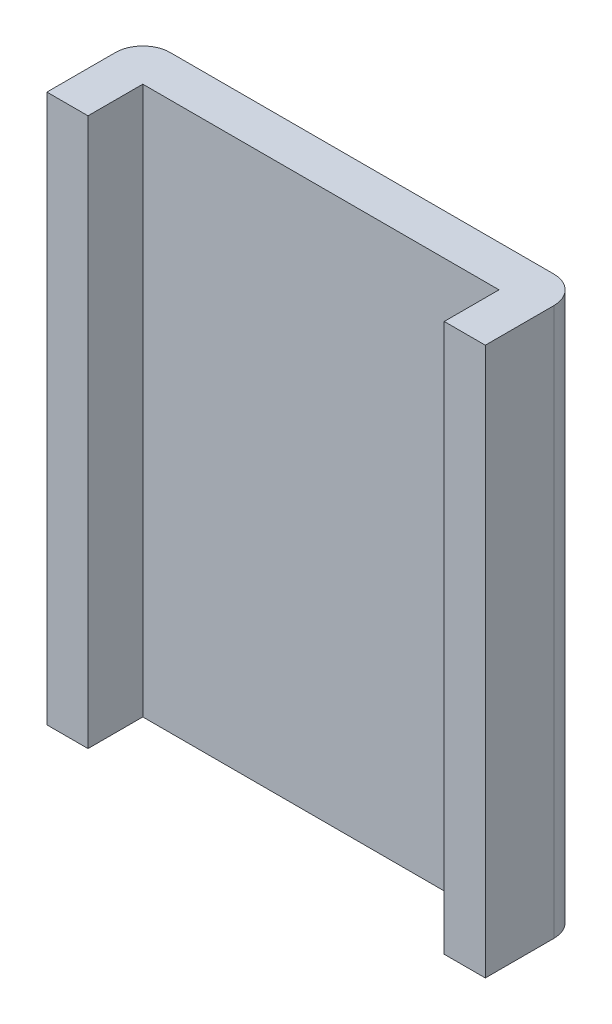
ISO-10303-21;
HEADER;
FILE_DESCRIPTION(('STEP AP214'),'2;1');
FILE_NAME('part.step','',(''),(''),'','','');
FILE_SCHEMA(('AUTOMOTIVE_DESIGN { 1 0 10303 214 1 1 1 1 }'));
ENDSEC;
DATA;
#1=APPLICATION_CONTEXT('core data for automotive mechanical design processes');
#2=APPLICATION_PROTOCOL_DEFINITION('international standard','automotive_design',2000,#1);
#3=PRODUCT_CONTEXT('',#1,'mechanical');
#4=PRODUCT('Part','Part','',(#3));
#5=PRODUCT_RELATED_PRODUCT_CATEGORY('part','',(#4));
#6=PRODUCT_DEFINITION_FORMATION('','',#4);
#7=PRODUCT_DEFINITION_CONTEXT('part definition',#1,'design');
#8=PRODUCT_DEFINITION('design','',#6,#7);
#9=PRODUCT_DEFINITION_SHAPE('','',#8);
#10=(LENGTH_UNIT() NAMED_UNIT(*) SI_UNIT(.MILLI.,.METRE.));
#11=(NAMED_UNIT(*) PLANE_ANGLE_UNIT() SI_UNIT($,.RADIAN.));
#12=(NAMED_UNIT(*) SI_UNIT($,.STERADIAN.) SOLID_ANGLE_UNIT());
#13=UNCERTAINTY_MEASURE_WITH_UNIT(LENGTH_MEASURE(1.E-05),#10,'distance_accuracy_value','');
#14=(GEOMETRIC_REPRESENTATION_CONTEXT(3) GLOBAL_UNCERTAINTY_ASSIGNED_CONTEXT((#13)) GLOBAL_UNIT_ASSIGNED_CONTEXT((#10,
#11,#12)) REPRESENTATION_CONTEXT('',''));
#15=CARTESIAN_POINT('',(0.,0.,0.));
#16=DIRECTION('',(0.,0.,1.));
#17=DIRECTION('',(1.,0.,0.));
#18=AXIS2_PLACEMENT_3D('',#15,#16,#17);
#19=CARTESIAN_POINT('',(0.,5.,0.75));
#20=DIRECTION('',(0.,1.,0.));
#21=DIRECTION('',(0.,0.,1.));
#22=AXIS2_PLACEMENT_3D('',#19,#20,#21);
#23=PLANE('',#22);
#24=DIRECTION('',(0.,0.,-1.));
#25=VECTOR('',#24,1.);
#26=CARTESIAN_POINT('',(4.,5.,1.75));
#27=LINE('',#26,#25);
#28=CARTESIAN_POINT('',(4.,5.,1.75));
#29=VERTEX_POINT('',#28);
#30=CARTESIAN_POINT('',(4.,5.,0.5));
#31=VERTEX_POINT('',#30);
#32=EDGE_CURVE('E155',#29,#31,#27,.T.);
#33=ORIENTED_EDGE('',*,*,#32,.T.);
#34=CARTESIAN_POINT('',(3.5,5.,0.5));
#35=DIRECTION('',(0.,1.,0.));
#36=DIRECTION('',(0.,0.,1.));
#37=AXIS2_PLACEMENT_3D('',#34,#35,#36);
#38=CIRCLE('',#37,0.5);
#39=CARTESIAN_POINT('',(3.5,5.,0.));
#40=VERTEX_POINT('',#39);
#41=EDGE_CURVE('E43',#31,#40,#38,.T.);
#42=ORIENTED_EDGE('',*,*,#41,.T.);
#43=DIRECTION('',(1.,0.,0.));
#44=VECTOR('',#43,1.);
#45=CARTESIAN_POINT('',(0.,5.,0.));
#46=LINE('',#45,#44);
#47=CARTESIAN_POINT('',(-3.5,5.,0.));
#48=VERTEX_POINT('',#47);
#49=EDGE_CURVE('E165',#48,#40,#46,.T.);
#50=ORIENTED_EDGE('',*,*,#49,.F.);
#51=CARTESIAN_POINT('',(-3.5,5.,0.5));
#52=DIRECTION('',(0.,1.,0.));
#53=DIRECTION('',(0.,0.,1.));
#54=AXIS2_PLACEMENT_3D('',#51,#52,#53);
#55=CIRCLE('',#54,0.5);
#56=CARTESIAN_POINT('',(-4.,5.,0.5));
#57=VERTEX_POINT('',#56);
#58=EDGE_CURVE('E50',#48,#57,#55,.T.);
#59=ORIENTED_EDGE('',*,*,#58,.T.);
#60=DIRECTION('',(0.,0.,-1.));
#61=VECTOR('',#60,1.);
#62=CARTESIAN_POINT('',(-4.,5.,1.75));
#63=LINE('',#62,#61);
#64=CARTESIAN_POINT('',(-4.,5.,1.75));
#65=VERTEX_POINT('',#64);
#66=EDGE_CURVE('E124',#65,#57,#63,.T.);
#67=ORIENTED_EDGE('',*,*,#66,.F.);
#68=DIRECTION('',(1.,0.,0.));
#69=VECTOR('',#68,1.);
#70=CARTESIAN_POINT('',(0.,5.,1.75));
#71=LINE('',#70,#69);
#72=CARTESIAN_POINT('',(-3.25,5.,1.75));
#73=VERTEX_POINT('',#72);
#74=EDGE_CURVE('E129',#65,#73,#71,.T.);
#75=ORIENTED_EDGE('',*,*,#74,.T.);
#76=DIRECTION('',(0.,0.,-1.));
#77=VECTOR('',#76,1.);
#78=CARTESIAN_POINT('',(-3.25,5.,1.75));
#79=LINE('',#78,#77);
#80=CARTESIAN_POINT('',(-3.25,5.,0.75));
#81=VERTEX_POINT('',#80);
#82=EDGE_CURVE('E114',#73,#81,#79,.T.);
#83=ORIENTED_EDGE('',*,*,#82,.T.);
#84=DIRECTION('',(1.,0.,0.));
#85=VECTOR('',#84,1.);
#86=CARTESIAN_POINT('',(0.,5.,0.75));
#87=LINE('',#86,#85);
#88=CARTESIAN_POINT('',(3.25,5.,0.75));
#89=VERTEX_POINT('',#88);
#90=EDGE_CURVE('E169',#81,#89,#87,.T.);
#91=ORIENTED_EDGE('',*,*,#90,.T.);
#92=DIRECTION('',(0.,0.,-1.));
#93=VECTOR('',#92,1.);
#94=CARTESIAN_POINT('',(3.25,5.,1.75));
#95=LINE('',#94,#93);
#96=CARTESIAN_POINT('',(3.25,5.,1.75));
#97=VERTEX_POINT('',#96);
#98=EDGE_CURVE('E162',#97,#89,#95,.T.);
#99=ORIENTED_EDGE('',*,*,#98,.F.);
#100=DIRECTION('',(1.,0.,0.));
#101=VECTOR('',#100,1.);
#102=CARTESIAN_POINT('',(0.,5.,1.75));
#103=LINE('',#102,#101);
#104=EDGE_CURVE('E123',#97,#29,#103,.T.);
#105=ORIENTED_EDGE('',*,*,#104,.T.);
#106=EDGE_LOOP('',(#33,#42,#50,#59,#67,#75,#83,#91,#99,#105));
#107=FACE_BOUND('',#106,.T.);
#108=ADVANCED_FACE('F35',(#107),#23,.T.);
#109=CARTESIAN_POINT('',(0.,-5.,0.75));
#110=DIRECTION('',(0.,1.,0.));
#111=DIRECTION('',(0.,0.,1.));
#112=AXIS2_PLACEMENT_3D('',#109,#110,#111);
#113=PLANE('',#112);
#114=DIRECTION('',(1.,0.,0.));
#115=VECTOR('',#114,1.);
#116=CARTESIAN_POINT('',(0.,-5.,0.));
#117=LINE('',#116,#115);
#118=CARTESIAN_POINT('',(-3.5,-5.,0.));
#119=VERTEX_POINT('',#118);
#120=CARTESIAN_POINT('',(3.5,-5.,0.));
#121=VERTEX_POINT('',#120);
#122=EDGE_CURVE('E170',#119,#121,#117,.T.);
#123=ORIENTED_EDGE('',*,*,#122,.T.);
#124=CARTESIAN_POINT('',(3.5,-5.,0.5));
#125=DIRECTION('',(0.,1.,0.));
#126=DIRECTION('',(0.,0.,1.));
#127=AXIS2_PLACEMENT_3D('',#124,#125,#126);
#128=CIRCLE('',#127,0.5);
#129=CARTESIAN_POINT('',(4.,-5.,0.5));
#130=VERTEX_POINT('',#129);
#131=EDGE_CURVE('E186',#121,#130,#128,.F.);
#132=ORIENTED_EDGE('',*,*,#131,.T.);
#133=DIRECTION('',(0.,0.,-1.));
#134=VECTOR('',#133,1.);
#135=CARTESIAN_POINT('',(4.,-5.,1.75));
#136=LINE('',#135,#134);
#137=CARTESIAN_POINT('',(4.,-5.,1.75));
#138=VERTEX_POINT('',#137);
#139=EDGE_CURVE('E157',#138,#130,#136,.T.);
#140=ORIENTED_EDGE('',*,*,#139,.F.);
#141=DIRECTION('',(1.,0.,0.));
#142=VECTOR('',#141,1.);
#143=CARTESIAN_POINT('',(0.,-5.,1.75));
#144=LINE('',#143,#142);
#145=CARTESIAN_POINT('',(3.25,-5.,1.75));
#146=VERTEX_POINT('',#145);
#147=EDGE_CURVE('E150',#146,#138,#144,.T.);
#148=ORIENTED_EDGE('',*,*,#147,.F.);
#149=DIRECTION('',(0.,0.,-1.));
#150=VECTOR('',#149,1.);
#151=CARTESIAN_POINT('',(3.25,-5.,1.75));
#152=LINE('',#151,#150);
#153=CARTESIAN_POINT('',(3.25,-5.,0.75));
#154=VERTEX_POINT('',#153);
#155=EDGE_CURVE('E159',#146,#154,#152,.T.);
#156=ORIENTED_EDGE('',*,*,#155,.T.);
#157=DIRECTION('',(1.,0.,0.));
#158=VECTOR('',#157,1.);
#159=CARTESIAN_POINT('',(0.,-5.,0.75));
#160=LINE('',#159,#158);
#161=CARTESIAN_POINT('',(-3.25,-5.,0.75));
#162=VERTEX_POINT('',#161);
#163=EDGE_CURVE('E173',#162,#154,#160,.T.);
#164=ORIENTED_EDGE('',*,*,#163,.F.);
#165=DIRECTION('',(0.,0.,-1.));
#166=VECTOR('',#165,1.);
#167=CARTESIAN_POINT('',(-3.25,-5.,1.75));
#168=LINE('',#167,#166);
#169=CARTESIAN_POINT('',(-3.25,-5.,1.75));
#170=VERTEX_POINT('',#169);
#171=EDGE_CURVE('E140',#170,#162,#168,.T.);
#172=ORIENTED_EDGE('',*,*,#171,.F.);
#173=DIRECTION('',(1.,0.,0.));
#174=VECTOR('',#173,1.);
#175=CARTESIAN_POINT('',(0.,-5.,1.75));
#176=LINE('',#175,#174);
#177=CARTESIAN_POINT('',(-4.,-5.,1.75));
#178=VERTEX_POINT('',#177);
#179=EDGE_CURVE('E131',#178,#170,#176,.T.);
#180=ORIENTED_EDGE('',*,*,#179,.F.);
#181=DIRECTION('',(0.,0.,-1.));
#182=VECTOR('',#181,1.);
#183=CARTESIAN_POINT('',(-4.,-5.,1.75));
#184=LINE('',#183,#182);
#185=CARTESIAN_POINT('',(-4.,-5.,0.5));
#186=VERTEX_POINT('',#185);
#187=EDGE_CURVE('E142',#178,#186,#184,.T.);
#188=ORIENTED_EDGE('',*,*,#187,.T.);
#189=CARTESIAN_POINT('',(-3.5,-5.,0.5));
#190=DIRECTION('',(0.,1.,0.));
#191=DIRECTION('',(0.,0.,1.));
#192=AXIS2_PLACEMENT_3D('',#189,#190,#191);
#193=CIRCLE('',#192,0.5);
#194=EDGE_CURVE('E184',#186,#119,#193,.F.);
#195=ORIENTED_EDGE('',*,*,#194,.T.);
#196=EDGE_LOOP('',(#123,#132,#140,#148,#156,#164,#172,#180,#188,#195));
#197=FACE_BOUND('',#196,.T.);
#198=ADVANCED_FACE('F199',(#197),#113,.F.);
#199=CARTESIAN_POINT('',(0.,0.,0.75));
#200=DIRECTION('',(0.,0.,1.));
#201=DIRECTION('',(1.,0.,0.));
#202=AXIS2_PLACEMENT_3D('',#199,#200,#201);
#203=PLANE('',#202);
#204=DIRECTION('',(0.,-1.,0.));
#205=VECTOR('',#204,1.);
#206=CARTESIAN_POINT('',(3.25,0.,0.75));
#207=LINE('',#206,#205);
#208=EDGE_CURVE('E166',#89,#154,#207,.T.);
#209=ORIENTED_EDGE('',*,*,#208,.F.);
#210=ORIENTED_EDGE('',*,*,#90,.F.);
#211=DIRECTION('',(0.,-1.,0.));
#212=VECTOR('',#211,1.);
#213=CARTESIAN_POINT('',(-3.25,0.,0.75));
#214=LINE('',#213,#212);
#215=EDGE_CURVE('E119',#81,#162,#214,.T.);
#216=ORIENTED_EDGE('',*,*,#215,.T.);
#217=ORIENTED_EDGE('',*,*,#163,.T.);
#218=EDGE_LOOP('',(#209,#210,#216,#217));
#219=FACE_BOUND('',#218,.T.);
#220=ADVANCED_FACE('F212',(#219),#203,.T.);
#221=CARTESIAN_POINT('',(0.,0.,0.));
#222=DIRECTION('',(0.,0.,1.));
#223=DIRECTION('',(1.,0.,0.));
#224=AXIS2_PLACEMENT_3D('',#221,#222,#223);
#225=PLANE('',#224);
#226=ORIENTED_EDGE('',*,*,#49,.T.);
#227=DIRECTION('',(0.,-1.,0.));
#228=VECTOR('',#227,1.);
#229=CARTESIAN_POINT('',(3.5,-5.,0.));
#230=LINE('',#229,#228);
#231=EDGE_CURVE('E181',#40,#121,#230,.T.);
#232=ORIENTED_EDGE('',*,*,#231,.T.);
#233=ORIENTED_EDGE('',*,*,#122,.F.);
#234=DIRECTION('',(0.,-1.,0.));
#235=VECTOR('',#234,1.);
#236=CARTESIAN_POINT('',(-3.5,0.,0.));
#237=LINE('',#236,#235);
#238=EDGE_CURVE('E175',#119,#48,#237,.F.);
#239=ORIENTED_EDGE('',*,*,#238,.T.);
#240=EDGE_LOOP('',(#226,#232,#233,#239));
#241=FACE_BOUND('',#240,.T.);
#242=ADVANCED_FACE('F193',(#241),#225,.F.);
#243=CARTESIAN_POINT('',(3.25,0.,1.75));
#244=DIRECTION('',(1.,0.,0.));
#245=DIRECTION('',(0.,1.,0.));
#246=AXIS2_PLACEMENT_3D('',#243,#244,#245);
#247=PLANE('',#246);
#248=ORIENTED_EDGE('',*,*,#98,.T.);
#249=ORIENTED_EDGE('',*,*,#208,.T.);
#250=ORIENTED_EDGE('',*,*,#155,.F.);
#251=DIRECTION('',(0.,-1.,0.));
#252=VECTOR('',#251,1.);
#253=CARTESIAN_POINT('',(3.25,0.,1.75));
#254=LINE('',#253,#252);
#255=EDGE_CURVE('E148',#97,#146,#254,.T.);
#256=ORIENTED_EDGE('',*,*,#255,.F.);
#257=EDGE_LOOP('',(#248,#249,#250,#256));
#258=FACE_BOUND('',#257,.T.);
#259=ADVANCED_FACE('F210',(#258),#247,.F.);
#260=CARTESIAN_POINT('',(4.,0.,1.75));
#261=DIRECTION('',(1.,0.,0.));
#262=DIRECTION('',(0.,1.,0.));
#263=AXIS2_PLACEMENT_3D('',#260,#261,#262);
#264=PLANE('',#263);
#265=ORIENTED_EDGE('',*,*,#139,.T.);
#266=DIRECTION('',(0.,-1.,0.));
#267=VECTOR('',#266,1.);
#268=CARTESIAN_POINT('',(4.,5.,0.5));
#269=LINE('',#268,#267);
#270=EDGE_CURVE('E58',#130,#31,#269,.F.);
#271=ORIENTED_EDGE('',*,*,#270,.T.);
#272=ORIENTED_EDGE('',*,*,#32,.F.);
#273=DIRECTION('',(0.,-1.,0.));
#274=VECTOR('',#273,1.);
#275=CARTESIAN_POINT('',(4.,0.,1.75));
#276=LINE('',#275,#274);
#277=EDGE_CURVE('E152',#29,#138,#276,.T.);
#278=ORIENTED_EDGE('',*,*,#277,.T.);
#279=EDGE_LOOP('',(#265,#271,#272,#278));
#280=FACE_BOUND('',#279,.T.);
#281=ADVANCED_FACE('F201',(#280),#264,.T.);
#282=CARTESIAN_POINT('',(0.,0.,1.75));
#283=DIRECTION('',(0.,0.,1.));
#284=DIRECTION('',(1.,0.,0.));
#285=AXIS2_PLACEMENT_3D('',#282,#283,#284);
#286=PLANE('',#285);
#287=ORIENTED_EDGE('',*,*,#104,.F.);
#288=ORIENTED_EDGE('',*,*,#255,.T.);
#289=ORIENTED_EDGE('',*,*,#147,.T.);
#290=ORIENTED_EDGE('',*,*,#277,.F.);
#291=EDGE_LOOP('',(#287,#288,#289,#290));
#292=FACE_BOUND('',#291,.T.);
#293=ADVANCED_FACE('F205',(#292),#286,.T.);
#294=CARTESIAN_POINT('',(-3.25,0.,1.75));
#295=DIRECTION('',(1.,0.,0.));
#296=DIRECTION('',(0.,1.,0.));
#297=AXIS2_PLACEMENT_3D('',#294,#295,#296);
#298=PLANE('',#297);
#299=ORIENTED_EDGE('',*,*,#215,.F.);
#300=ORIENTED_EDGE('',*,*,#82,.F.);
#301=DIRECTION('',(0.,-1.,0.));
#302=VECTOR('',#301,1.);
#303=CARTESIAN_POINT('',(-3.25,0.,1.75));
#304=LINE('',#303,#302);
#305=EDGE_CURVE('E117',#73,#170,#304,.T.);
#306=ORIENTED_EDGE('',*,*,#305,.T.);
#307=ORIENTED_EDGE('',*,*,#171,.T.);
#308=EDGE_LOOP('',(#299,#300,#306,#307));
#309=FACE_BOUND('',#308,.T.);
#310=ADVANCED_FACE('F116',(#309),#298,.T.);
#311=CARTESIAN_POINT('',(-4.,0.,1.75));
#312=DIRECTION('',(1.,0.,0.));
#313=DIRECTION('',(0.,1.,0.));
#314=AXIS2_PLACEMENT_3D('',#311,#312,#313);
#315=PLANE('',#314);
#316=ORIENTED_EDGE('',*,*,#66,.T.);
#317=DIRECTION('',(0.,-1.,0.));
#318=VECTOR('',#317,1.);
#319=CARTESIAN_POINT('',(-4.,0.,0.5));
#320=LINE('',#319,#318);
#321=EDGE_CURVE('E11',#57,#186,#320,.T.);
#322=ORIENTED_EDGE('',*,*,#321,.T.);
#323=ORIENTED_EDGE('',*,*,#187,.F.);
#324=DIRECTION('',(0.,-1.,0.));
#325=VECTOR('',#324,1.);
#326=CARTESIAN_POINT('',(-4.,0.,1.75));
#327=LINE('',#326,#325);
#328=EDGE_CURVE('E135',#65,#178,#327,.T.);
#329=ORIENTED_EDGE('',*,*,#328,.F.);
#330=EDGE_LOOP('',(#316,#322,#323,#329));
#331=FACE_BOUND('',#330,.T.);
#332=ADVANCED_FACE('F232',(#331),#315,.F.);
#333=CARTESIAN_POINT('',(0.,0.,1.75));
#334=DIRECTION('',(0.,0.,1.));
#335=DIRECTION('',(1.,0.,0.));
#336=AXIS2_PLACEMENT_3D('',#333,#334,#335);
#337=PLANE('',#336);
#338=ORIENTED_EDGE('',*,*,#305,.F.);
#339=ORIENTED_EDGE('',*,*,#74,.F.);
#340=ORIENTED_EDGE('',*,*,#328,.T.);
#341=ORIENTED_EDGE('',*,*,#179,.T.);
#342=EDGE_LOOP('',(#338,#339,#340,#341));
#343=FACE_BOUND('',#342,.T.);
#344=ADVANCED_FACE('F128',(#343),#337,.T.);
#345=CARTESIAN_POINT('',(3.5,0.,0.5));
#346=DIRECTION('',(0.,1.,0.));
#347=DIRECTION('',(-1.,0.,0.));
#348=AXIS2_PLACEMENT_3D('',#345,#346,#347);
#349=CYLINDRICAL_SURFACE('',#348,0.5);
#350=ORIENTED_EDGE('',*,*,#41,.F.);
#351=ORIENTED_EDGE('',*,*,#270,.F.);
#352=ORIENTED_EDGE('',*,*,#131,.F.);
#353=ORIENTED_EDGE('',*,*,#231,.F.);
#354=EDGE_LOOP('',(#350,#351,#352,#353));
#355=FACE_BOUND('',#354,.T.);
#356=ADVANCED_FACE('F196',(#355),#349,.T.);
#357=CARTESIAN_POINT('',(-3.5,0.,0.5));
#358=DIRECTION('',(0.,-1.,0.));
#359=DIRECTION('',(1.,0.,0.));
#360=AXIS2_PLACEMENT_3D('',#357,#358,#359);
#361=CYLINDRICAL_SURFACE('',#360,0.5);
#362=ORIENTED_EDGE('',*,*,#58,.F.);
#363=ORIENTED_EDGE('',*,*,#238,.F.);
#364=ORIENTED_EDGE('',*,*,#194,.F.);
#365=ORIENTED_EDGE('',*,*,#321,.F.);
#366=EDGE_LOOP('',(#362,#363,#364,#365));
#367=FACE_BOUND('',#366,.T.);
#368=ADVANCED_FACE('F37',(#367),#361,.T.);
#369=CLOSED_SHELL('',(#108,#198,#220,#242,#259,#281,#293,#310,#332,#344,#356,#368));
#370=MANIFOLD_SOLID_BREP('B2',#369);
#371=ADVANCED_BREP_SHAPE_REPRESENTATION('',(#18,#370),#14);
#372=SHAPE_DEFINITION_REPRESENTATION(#9,#371);
ENDSEC;
END-ISO-10303-21;
